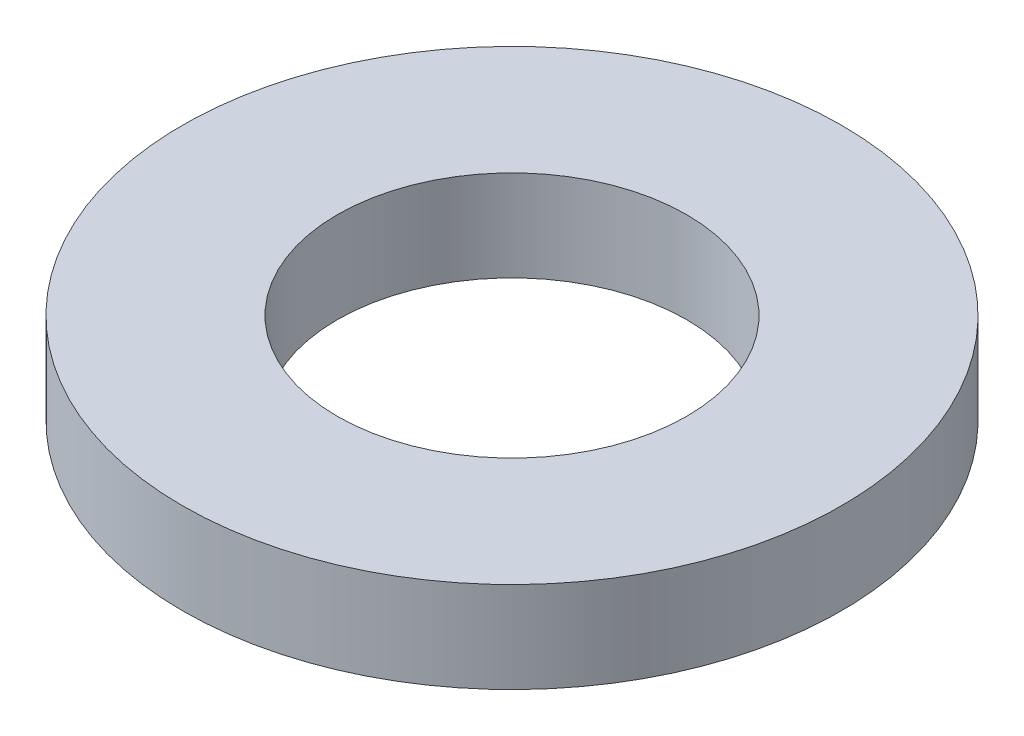
ISO-10303-21;
HEADER;
FILE_DESCRIPTION(('STEP AP214'),'2;1');
FILE_NAME('part.step','',(''),(''),'','','');
FILE_SCHEMA(('AUTOMOTIVE_DESIGN { 1 0 10303 214 1 1 1 1 }'));
ENDSEC;
DATA;
#1=APPLICATION_CONTEXT('core data for automotive mechanical design processes');
#2=APPLICATION_PROTOCOL_DEFINITION('international standard','automotive_design',2000,#1);
#3=PRODUCT_CONTEXT('',#1,'mechanical');
#4=PRODUCT('Part','Part','',(#3));
#5=PRODUCT_RELATED_PRODUCT_CATEGORY('part','',(#4));
#6=PRODUCT_DEFINITION_FORMATION('','',#4);
#7=PRODUCT_DEFINITION_CONTEXT('part definition',#1,'design');
#8=PRODUCT_DEFINITION('design','',#6,#7);
#9=PRODUCT_DEFINITION_SHAPE('','',#8);
#10=(LENGTH_UNIT() NAMED_UNIT(*) SI_UNIT(.MILLI.,.METRE.));
#11=(NAMED_UNIT(*) PLANE_ANGLE_UNIT() SI_UNIT($,.RADIAN.));
#12=(NAMED_UNIT(*) SI_UNIT($,.STERADIAN.) SOLID_ANGLE_UNIT());
#13=UNCERTAINTY_MEASURE_WITH_UNIT(LENGTH_MEASURE(1.E-05),#10,'distance_accuracy_value','');
#14=(GEOMETRIC_REPRESENTATION_CONTEXT(3) GLOBAL_UNCERTAINTY_ASSIGNED_CONTEXT((#13)) GLOBAL_UNIT_ASSIGNED_CONTEXT((#10,
#11,#12)) REPRESENTATION_CONTEXT('',''));
#15=CARTESIAN_POINT('',(0.,0.,0.));
#16=DIRECTION('',(0.,0.,1.));
#17=DIRECTION('',(1.,0.,0.));
#18=AXIS2_PLACEMENT_3D('',#15,#16,#17);
#19=CARTESIAN_POINT('',(0.,1.7526,0.));
#20=DIRECTION('',(0.,-1.,0.));
#21=DIRECTION('',(0.,0.,-1.));
#22=AXIS2_PLACEMENT_3D('',#19,#20,#21);
#23=CYLINDRICAL_SURFACE('',#22,6.35);
#24=CARTESIAN_POINT('',(0.,1.7526,0.));
#25=DIRECTION('',(0.,1.,0.));
#26=DIRECTION('',(0.,0.,1.));
#27=AXIS2_PLACEMENT_3D('',#24,#25,#26);
#28=CIRCLE('',#27,6.35);
#29=CARTESIAN_POINT('',(0.,1.7526,6.35));
#30=VERTEX_POINT('',#29);
#31=EDGE_CURVE('E10',#30,#30,#28,.T.);
#32=ORIENTED_EDGE('',*,*,#31,.F.);
#33=EDGE_LOOP('',(#32));
#34=FACE_BOUND('',#33,.T.);
#35=CARTESIAN_POINT('',(0.,0.,0.));
#36=DIRECTION('',(0.,1.,0.));
#37=DIRECTION('',(0.,0.,1.));
#38=AXIS2_PLACEMENT_3D('',#35,#36,#37);
#39=CIRCLE('',#38,6.35);
#40=CARTESIAN_POINT('',(0.,0.,6.35));
#41=VERTEX_POINT('',#40);
#42=EDGE_CURVE('E33',#41,#41,#39,.T.);
#43=ORIENTED_EDGE('',*,*,#42,.T.);
#44=EDGE_LOOP('',(#43));
#45=FACE_BOUND('',#44,.T.);
#46=ADVANCED_FACE('F30',(#34,#45),#23,.T.);
#47=CARTESIAN_POINT('',(0.,1.7526,0.));
#48=DIRECTION('',(0.,1.,0.));
#49=DIRECTION('',(0.,0.,1.));
#50=AXIS2_PLACEMENT_3D('',#47,#48,#49);
#51=PLANE('',#50);
#52=CARTESIAN_POINT('',(0.,1.7526,0.));
#53=DIRECTION('',(0.,1.,0.));
#54=DIRECTION('',(0.,0.,1.));
#55=AXIS2_PLACEMENT_3D('',#52,#53,#54);
#56=CIRCLE('',#55,3.3655);
#57=CARTESIAN_POINT('',(0.,1.7526,3.3655));
#58=VERTEX_POINT('',#57);
#59=EDGE_CURVE('E42',#58,#58,#56,.T.);
#60=ORIENTED_EDGE('',*,*,#59,.F.);
#61=EDGE_LOOP('',(#60));
#62=FACE_BOUND('',#61,.T.);
#63=ORIENTED_EDGE('',*,*,#31,.T.);
#64=EDGE_LOOP('',(#63));
#65=FACE_BOUND('',#64,.T.);
#66=ADVANCED_FACE('F57',(#62,#65),#51,.T.);
#67=CARTESIAN_POINT('',(0.,0.,0.));
#68=DIRECTION('',(0.,1.,0.));
#69=DIRECTION('',(0.,0.,1.));
#70=AXIS2_PLACEMENT_3D('',#67,#68,#69);
#71=PLANE('',#70);
#72=CARTESIAN_POINT('',(0.,0.,0.));
#73=DIRECTION('',(0.,1.,0.));
#74=DIRECTION('',(0.,0.,1.));
#75=AXIS2_PLACEMENT_3D('',#72,#73,#74);
#76=CIRCLE('',#75,3.3655);
#77=CARTESIAN_POINT('',(0.,0.,3.3655));
#78=VERTEX_POINT('',#77);
#79=EDGE_CURVE('E40',#78,#78,#76,.T.);
#80=ORIENTED_EDGE('',*,*,#79,.T.);
#81=EDGE_LOOP('',(#80));
#82=FACE_BOUND('',#81,.T.);
#83=ORIENTED_EDGE('',*,*,#42,.F.);
#84=EDGE_LOOP('',(#83));
#85=FACE_BOUND('',#84,.T.);
#86=ADVANCED_FACE('F48',(#82,#85),#71,.F.);
#87=CARTESIAN_POINT('',(0.,0.,0.));
#88=DIRECTION('',(0.,1.,0.));
#89=DIRECTION('',(0.,0.,1.));
#90=AXIS2_PLACEMENT_3D('',#87,#88,#89);
#91=CYLINDRICAL_SURFACE('',#90,3.3655);
#92=ORIENTED_EDGE('',*,*,#79,.F.);
#93=EDGE_LOOP('',(#92));
#94=FACE_BOUND('',#93,.T.);
#95=ORIENTED_EDGE('',*,*,#59,.T.);
#96=EDGE_LOOP('',(#95));
#97=FACE_BOUND('',#96,.T.);
#98=ADVANCED_FACE('F51',(#94,#97),#91,.F.);
#99=CLOSED_SHELL('',(#46,#66,#86,#98));
#100=MANIFOLD_SOLID_BREP('B2',#99);
#101=ADVANCED_BREP_SHAPE_REPRESENTATION('',(#18,#100),#14);
#102=SHAPE_DEFINITION_REPRESENTATION(#9,#101);
ENDSEC;
END-ISO-10303-21;
